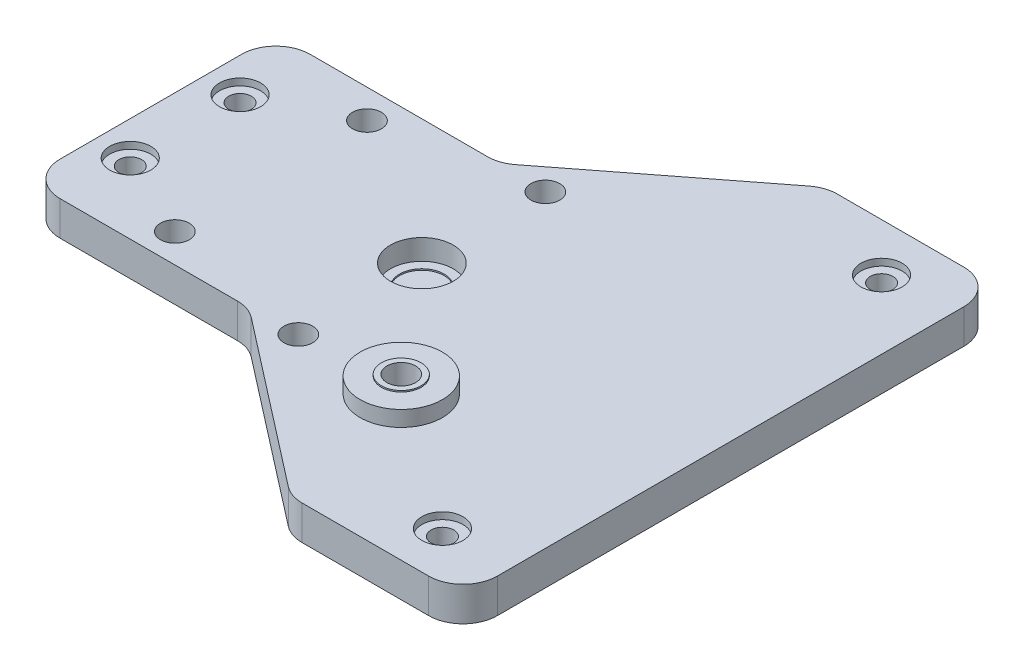
ISO-10303-21;
HEADER;
FILE_DESCRIPTION(('STEP AP214'),'2;1');
FILE_NAME('part.step','',(''),(''),'','','');
FILE_SCHEMA(('AUTOMOTIVE_DESIGN { 1 0 10303 214 1 1 1 1 }'));
ENDSEC;
DATA;
#1=APPLICATION_CONTEXT('core data for automotive mechanical design processes');
#2=APPLICATION_PROTOCOL_DEFINITION('international standard','automotive_design',2000,#1);
#3=PRODUCT_CONTEXT('',#1,'mechanical');
#4=PRODUCT('Part','Part','',(#3));
#5=PRODUCT_RELATED_PRODUCT_CATEGORY('part','',(#4));
#6=PRODUCT_DEFINITION_FORMATION('','',#4);
#7=PRODUCT_DEFINITION_CONTEXT('part definition',#1,'design');
#8=PRODUCT_DEFINITION('design','',#6,#7);
#9=PRODUCT_DEFINITION_SHAPE('','',#8);
#10=(LENGTH_UNIT() NAMED_UNIT(*) SI_UNIT(.MILLI.,.METRE.));
#11=(NAMED_UNIT(*) PLANE_ANGLE_UNIT() SI_UNIT($,.RADIAN.));
#12=(NAMED_UNIT(*) SI_UNIT($,.STERADIAN.) SOLID_ANGLE_UNIT());
#13=UNCERTAINTY_MEASURE_WITH_UNIT(LENGTH_MEASURE(1.E-05),#10,'distance_accuracy_value','');
#14=(GEOMETRIC_REPRESENTATION_CONTEXT(3) GLOBAL_UNCERTAINTY_ASSIGNED_CONTEXT((#13)) GLOBAL_UNIT_ASSIGNED_CONTEXT((#10,
#11,#12)) REPRESENTATION_CONTEXT('',''));
#15=CARTESIAN_POINT('',(0.,0.,0.));
#16=DIRECTION('',(0.,0.,1.));
#17=DIRECTION('',(1.,0.,0.));
#18=AXIS2_PLACEMENT_3D('',#15,#16,#17);
#19=CARTESIAN_POINT('',(-34.5,0.,-8.));
#20=DIRECTION('',(0.,1.,0.));
#21=DIRECTION('',(0.,0.,1.));
#22=AXIS2_PLACEMENT_3D('',#19,#20,#21);
#23=CYLINDRICAL_SURFACE('',#22,1.65);
#24=CARTESIAN_POINT('',(-34.5,0.,-8.));
#25=DIRECTION('',(0.,1.,0.));
#26=DIRECTION('',(0.,0.,1.));
#27=AXIS2_PLACEMENT_3D('',#24,#25,#26);
#28=CIRCLE('',#27,1.65);
#29=CARTESIAN_POINT('',(-34.5,0.,-6.35));
#30=VERTEX_POINT('',#29);
#31=EDGE_CURVE('E214',#30,#30,#28,.T.);
#32=ORIENTED_EDGE('',*,*,#31,.F.);
#33=EDGE_LOOP('',(#32));
#34=FACE_BOUND('',#33,.T.);
#35=CARTESIAN_POINT('',(-34.5,4.,-8.));
#36=DIRECTION('',(0.,1.,0.));
#37=DIRECTION('',(0.,0.,1.));
#38=AXIS2_PLACEMENT_3D('',#35,#36,#37);
#39=CIRCLE('',#38,1.65);
#40=CARTESIAN_POINT('',(-34.5,4.,-6.35));
#41=VERTEX_POINT('',#40);
#42=EDGE_CURVE('E44',#41,#41,#39,.F.);
#43=ORIENTED_EDGE('',*,*,#42,.F.);
#44=EDGE_LOOP('',(#43));
#45=FACE_BOUND('',#44,.T.);
#46=ADVANCED_FACE('F40',(#34,#45),#23,.F.);
#47=CARTESIAN_POINT('',(-34.5,0.,8.));
#48=DIRECTION('',(0.,1.,0.));
#49=DIRECTION('',(0.,0.,1.));
#50=AXIS2_PLACEMENT_3D('',#47,#48,#49);
#51=CYLINDRICAL_SURFACE('',#50,1.65);
#52=CARTESIAN_POINT('',(-34.5,0.,8.));
#53=DIRECTION('',(0.,1.,0.));
#54=DIRECTION('',(0.,0.,1.));
#55=AXIS2_PLACEMENT_3D('',#52,#53,#54);
#56=CIRCLE('',#55,1.65);
#57=CARTESIAN_POINT('',(-34.5,0.,9.65));
#58=VERTEX_POINT('',#57);
#59=EDGE_CURVE('E218',#58,#58,#56,.T.);
#60=ORIENTED_EDGE('',*,*,#59,.F.);
#61=EDGE_LOOP('',(#60));
#62=FACE_BOUND('',#61,.T.);
#63=CARTESIAN_POINT('',(-34.5,4.,8.));
#64=DIRECTION('',(0.,1.,0.));
#65=DIRECTION('',(0.,0.,1.));
#66=AXIS2_PLACEMENT_3D('',#63,#64,#65);
#67=CIRCLE('',#66,1.65);
#68=CARTESIAN_POINT('',(-34.5,4.,9.65));
#69=VERTEX_POINT('',#68);
#70=EDGE_CURVE('E323',#69,#69,#67,.F.);
#71=ORIENTED_EDGE('',*,*,#70,.F.);
#72=EDGE_LOOP('',(#71));
#73=FACE_BOUND('',#72,.T.);
#74=ADVANCED_FACE('F433',(#62,#73),#51,.F.);
#75=CARTESIAN_POINT('',(35.,0.,32.));
#76=DIRECTION('',(0.,1.,0.));
#77=DIRECTION('',(0.,0.,1.));
#78=AXIS2_PLACEMENT_3D('',#75,#76,#77);
#79=CYLINDRICAL_SURFACE('',#78,1.65);
#80=CARTESIAN_POINT('',(35.,0.,32.));
#81=DIRECTION('',(0.,1.,0.));
#82=DIRECTION('',(0.,0.,1.));
#83=AXIS2_PLACEMENT_3D('',#80,#81,#82);
#84=CIRCLE('',#83,1.65);
#85=CARTESIAN_POINT('',(35.,0.,33.65));
#86=VERTEX_POINT('',#85);
#87=EDGE_CURVE('E348',#86,#86,#84,.T.);
#88=ORIENTED_EDGE('',*,*,#87,.F.);
#89=EDGE_LOOP('',(#88));
#90=FACE_BOUND('',#89,.T.);
#91=CARTESIAN_POINT('',(35.,4.,32.));
#92=DIRECTION('',(0.,1.,0.));
#93=DIRECTION('',(0.,0.,1.));
#94=AXIS2_PLACEMENT_3D('',#91,#92,#93);
#95=CIRCLE('',#94,1.65);
#96=CARTESIAN_POINT('',(35.,4.,33.65));
#97=VERTEX_POINT('',#96);
#98=EDGE_CURVE('E320',#97,#97,#95,.F.);
#99=ORIENTED_EDGE('',*,*,#98,.F.);
#100=EDGE_LOOP('',(#99));
#101=FACE_BOUND('',#100,.T.);
#102=ADVANCED_FACE('F439',(#90,#101),#79,.F.);
#103=CARTESIAN_POINT('',(35.,0.,-32.));
#104=DIRECTION('',(0.,1.,0.));
#105=DIRECTION('',(0.,0.,1.));
#106=AXIS2_PLACEMENT_3D('',#103,#104,#105);
#107=CYLINDRICAL_SURFACE('',#106,1.65);
#108=CARTESIAN_POINT('',(35.,0.,-32.));
#109=DIRECTION('',(0.,1.,0.));
#110=DIRECTION('',(0.,0.,1.));
#111=AXIS2_PLACEMENT_3D('',#108,#109,#110);
#112=CIRCLE('',#111,1.65);
#113=CARTESIAN_POINT('',(35.,0.,-30.35));
#114=VERTEX_POINT('',#113);
#115=EDGE_CURVE('E349',#114,#114,#112,.T.);
#116=ORIENTED_EDGE('',*,*,#115,.F.);
#117=EDGE_LOOP('',(#116));
#118=FACE_BOUND('',#117,.T.);
#119=CARTESIAN_POINT('',(35.,4.,-32.));
#120=DIRECTION('',(0.,1.,0.));
#121=DIRECTION('',(0.,0.,1.));
#122=AXIS2_PLACEMENT_3D('',#119,#120,#121);
#123=CIRCLE('',#122,1.65);
#124=CARTESIAN_POINT('',(35.,4.,-30.35));
#125=VERTEX_POINT('',#124);
#126=EDGE_CURVE('E317',#125,#125,#123,.F.);
#127=ORIENTED_EDGE('',*,*,#126,.F.);
#128=EDGE_LOOP('',(#127));
#129=FACE_BOUND('',#128,.T.);
#130=ADVANCED_FACE('F518',(#118,#129),#107,.F.);
#131=CARTESIAN_POINT('',(15.,7.275,18.));
#132=DIRECTION('',(0.,1.,0.));
#133=DIRECTION('',(0.,0.,1.));
#134=AXIS2_PLACEMENT_3D('',#131,#132,#133);
#135=PLANE('',#134);
#136=CARTESIAN_POINT('',(15.,7.275,18.));
#137=DIRECTION('',(0.,1.,0.));
#138=DIRECTION('',(0.,0.,1.));
#139=AXIS2_PLACEMENT_3D('',#136,#137,#138);
#140=CIRCLE('',#139,6.);
#141=CARTESIAN_POINT('',(15.,7.275,24.));
#142=VERTEX_POINT('',#141);
#143=EDGE_CURVE('E344',#142,#142,#140,.T.);
#144=ORIENTED_EDGE('',*,*,#143,.T.);
#145=EDGE_LOOP('',(#144));
#146=FACE_BOUND('',#145,.T.);
#147=CARTESIAN_POINT('',(15.,7.275,18.));
#148=DIRECTION('',(0.,1.,0.));
#149=DIRECTION('',(0.,0.,1.));
#150=AXIS2_PLACEMENT_3D('',#147,#148,#149);
#151=CIRCLE('',#150,2.9);
#152=CARTESIAN_POINT('',(15.,7.275,20.9));
#153=VERTEX_POINT('',#152);
#154=EDGE_CURVE('E332',#153,#153,#151,.T.);
#155=ORIENTED_EDGE('',*,*,#154,.F.);
#156=EDGE_LOOP('',(#155));
#157=FACE_BOUND('',#156,.T.);
#158=ADVANCED_FACE('F482',(#146,#157),#135,.T.);
#159=CARTESIAN_POINT('',(0.,5.,0.));
#160=DIRECTION('',(0.,-1.,0.));
#161=DIRECTION('',(0.,0.,-1.));
#162=AXIS2_PLACEMENT_3D('',#159,#160,#161);
#163=PLANE('',#162);
#164=CARTESIAN_POINT('',(35.,5.,-32.));
#165=DIRECTION('',(0.,1.,0.));
#166=DIRECTION('',(0.,0.,1.));
#167=AXIS2_PLACEMENT_3D('',#164,#165,#166);
#168=CIRCLE('',#167,3.);
#169=CARTESIAN_POINT('',(35.,5.,-29.));
#170=VERTEX_POINT('',#169);
#171=EDGE_CURVE('E761',#170,#170,#168,.T.);
#172=ORIENTED_EDGE('',*,*,#171,.F.);
#173=EDGE_LOOP('',(#172));
#174=FACE_BOUND('',#173,.T.);
#175=CARTESIAN_POINT('',(35.,5.,32.));
#176=DIRECTION('',(0.,1.,0.));
#177=DIRECTION('',(0.,0.,1.));
#178=AXIS2_PLACEMENT_3D('',#175,#176,#177);
#179=CIRCLE('',#178,3.);
#180=CARTESIAN_POINT('',(35.,5.,35.));
#181=VERTEX_POINT('',#180);
#182=EDGE_CURVE('E753',#181,#181,#179,.T.);
#183=ORIENTED_EDGE('',*,*,#182,.F.);
#184=EDGE_LOOP('',(#183));
#185=FACE_BOUND('',#184,.T.);
#186=CARTESIAN_POINT('',(-34.5,5.,8.));
#187=DIRECTION('',(0.,1.,0.));
#188=DIRECTION('',(0.,0.,1.));
#189=AXIS2_PLACEMENT_3D('',#186,#187,#188);
#190=CIRCLE('',#189,3.);
#191=CARTESIAN_POINT('',(-34.5,5.,11.));
#192=VERTEX_POINT('',#191);
#193=EDGE_CURVE('E746',#192,#192,#190,.T.);
#194=ORIENTED_EDGE('',*,*,#193,.F.);
#195=EDGE_LOOP('',(#194));
#196=FACE_BOUND('',#195,.T.);
#197=CARTESIAN_POINT('',(-34.5,5.,-8.));
#198=DIRECTION('',(0.,1.,0.));
#199=DIRECTION('',(0.,0.,1.));
#200=AXIS2_PLACEMENT_3D('',#197,#198,#199);
#201=CIRCLE('',#200,3.);
#202=CARTESIAN_POINT('',(-34.5,5.,-5.));
#203=VERTEX_POINT('',#202);
#204=EDGE_CURVE('E341',#203,#203,#201,.T.);
#205=ORIENTED_EDGE('',*,*,#204,.F.);
#206=EDGE_LOOP('',(#205));
#207=FACE_BOUND('',#206,.T.);
#208=CARTESIAN_POINT('',(-22.,5.,14.));
#209=DIRECTION('',(0.,1.,0.));
#210=DIRECTION('',(0.,0.,1.));
#211=AXIS2_PLACEMENT_3D('',#208,#209,#210);
#212=CIRCLE('',#211,2.1);
#213=CARTESIAN_POINT('',(-22.,5.,16.1));
#214=VERTEX_POINT('',#213);
#215=EDGE_CURVE('E239',#214,#214,#212,.T.);
#216=ORIENTED_EDGE('',*,*,#215,.F.);
#217=EDGE_LOOP('',(#216));
#218=FACE_BOUND('',#217,.T.);
#219=CARTESIAN_POINT('',(0.,5.,18.));
#220=DIRECTION('',(0.,1.,0.));
#221=DIRECTION('',(0.,0.,1.));
#222=AXIS2_PLACEMENT_3D('',#219,#220,#221);
#223=CIRCLE('',#222,2.1);
#224=CARTESIAN_POINT('',(0.,5.,20.1));
#225=VERTEX_POINT('',#224);
#226=EDGE_CURVE('E245',#225,#225,#223,.T.);
#227=ORIENTED_EDGE('',*,*,#226,.F.);
#228=EDGE_LOOP('',(#227));
#229=FACE_BOUND('',#228,.T.);
#230=CARTESIAN_POINT('',(0.,5.,-18.));
#231=DIRECTION('',(0.,1.,0.));
#232=DIRECTION('',(0.,0.,1.));
#233=AXIS2_PLACEMENT_3D('',#230,#231,#232);
#234=CIRCLE('',#233,2.1);
#235=CARTESIAN_POINT('',(0.,5.,-15.9));
#236=VERTEX_POINT('',#235);
#237=EDGE_CURVE('E251',#236,#236,#234,.T.);
#238=ORIENTED_EDGE('',*,*,#237,.F.);
#239=EDGE_LOOP('',(#238));
#240=FACE_BOUND('',#239,.T.);
#241=CARTESIAN_POINT('',(-22.,5.,-14.));
#242=DIRECTION('',(0.,1.,0.));
#243=DIRECTION('',(0.,0.,1.));
#244=AXIS2_PLACEMENT_3D('',#241,#242,#243);
#245=CIRCLE('',#244,2.1);
#246=CARTESIAN_POINT('',(-22.,5.,-11.9));
#247=VERTEX_POINT('',#246);
#248=EDGE_CURVE('E257',#247,#247,#245,.T.);
#249=ORIENTED_EDGE('',*,*,#248,.F.);
#250=EDGE_LOOP('',(#249));
#251=FACE_BOUND('',#250,.T.);
#252=DIRECTION('',(1.,0.,0.));
#253=VECTOR('',#252,1.);
#254=CARTESIAN_POINT('',(19.8422113683114,5.,39.));
#255=LINE('',#254,#253);
#256=CARTESIAN_POINT('',(21.5537987356417,5.,39.));
#257=VERTEX_POINT('',#256);
#258=CARTESIAN_POINT('',(40.,5.,38.9999999999999));
#259=VERTEX_POINT('',#258);
#260=EDGE_CURVE('E357',#257,#259,#255,.T.);
#261=ORIENTED_EDGE('',*,*,#260,.T.);
#262=CARTESIAN_POINT('',(40.,5.,33.9999999999999));
#263=DIRECTION('',(0.,-1.,0.));
#264=DIRECTION('',(0.,0.,-1.));
#265=AXIS2_PLACEMENT_3D('',#262,#263,#264);
#266=CIRCLE('',#265,5.);
#267=CARTESIAN_POINT('',(45.,5.,34.));
#268=VERTEX_POINT('',#267);
#269=EDGE_CURVE('E279',#259,#268,#266,.F.);
#270=ORIENTED_EDGE('',*,*,#269,.T.);
#271=DIRECTION('',(0.,0.,-1.));
#272=VECTOR('',#271,1.);
#273=CARTESIAN_POINT('',(45.,5.,-30.));
#274=LINE('',#273,#272);
#275=CARTESIAN_POINT('',(45.,5.,-34.0000000000001));
#276=VERTEX_POINT('',#275);
#277=EDGE_CURVE('E263',#268,#276,#274,.T.);
#278=ORIENTED_EDGE('',*,*,#277,.T.);
#279=CARTESIAN_POINT('',(40.,5.,-34.0000000000001));
#280=DIRECTION('',(0.,-1.,0.));
#281=DIRECTION('',(0.,0.,-1.));
#282=AXIS2_PLACEMENT_3D('',#279,#280,#281);
#283=CIRCLE('',#282,5.);
#284=CARTESIAN_POINT('',(40.,5.,-39.0000000000001));
#285=VERTEX_POINT('',#284);
#286=EDGE_CURVE('E273',#276,#285,#283,.F.);
#287=ORIENTED_EDGE('',*,*,#286,.T.);
#288=DIRECTION('',(-1.,0.,0.));
#289=VECTOR('',#288,1.);
#290=CARTESIAN_POINT('',(45.,5.,-39.0000000000001));
#291=LINE('',#290,#289);
#292=CARTESIAN_POINT('',(21.5537987356417,5.,-39.0000000000001));
#293=VERTEX_POINT('',#292);
#294=EDGE_CURVE('E360',#285,#293,#291,.T.);
#295=ORIENTED_EDGE('',*,*,#294,.T.);
#296=CARTESIAN_POINT('',(21.5537987356417,5.,-34.0000000000001));
#297=DIRECTION('',(0.,-1.,0.));
#298=DIRECTION('',(0.,0.,-1.));
#299=AXIS2_PLACEMENT_3D('',#296,#297,#298);
#300=CIRCLE('',#299,5.);
#301=CARTESIAN_POINT('',(18.4896811391723,5.,-37.9510990059738));
#302=VERTEX_POINT('',#301);
#303=EDGE_CURVE('E275',#293,#302,#300,.F.);
#304=ORIENTED_EDGE('',*,*,#303,.T.);
#305=DIRECTION('',(0.790219801194743,0.,-0.612823519293884));
#306=VECTOR('',#305,1.);
#307=CARTESIAN_POINT('',(-6.95101931897184,5.,-18.2215762016987));
#308=LINE('',#307,#306);
#309=CARTESIAN_POINT('',(-5.59848908983268,5.,-19.270477195725));
#310=VERTEX_POINT('',#309);
#311=EDGE_CURVE('E192',#310,#302,#308,.T.);
#312=ORIENTED_EDGE('',*,*,#311,.F.);
#313=CARTESIAN_POINT('',(-8.6626066863021,5.,-23.2215762016987));
#314=DIRECTION('',(0.,-1.,0.));
#315=DIRECTION('',(0.,0.,-1.));
#316=AXIS2_PLACEMENT_3D('',#313,#314,#315);
#317=CIRCLE('',#316,5.);
#318=CARTESIAN_POINT('',(-8.6626066863021,5.,-18.2215762016987));
#319=VERTEX_POINT('',#318);
#320=EDGE_CURVE('E314',#310,#319,#317,.T.);
#321=ORIENTED_EDGE('',*,*,#320,.T.);
#322=DIRECTION('',(1.,0.,0.));
#323=VECTOR('',#322,1.);
#324=CARTESIAN_POINT('',(-22.,5.,-18.2215762016987));
#325=LINE('',#324,#323);
#326=CARTESIAN_POINT('',(-34.5,5.,-18.2215762016987));
#327=VERTEX_POINT('',#326);
#328=EDGE_CURVE('E208',#327,#319,#325,.T.);
#329=ORIENTED_EDGE('',*,*,#328,.F.);
#330=CARTESIAN_POINT('',(-34.5,5.,-13.2215762016987));
#331=DIRECTION('',(0.,-1.,0.));
#332=DIRECTION('',(0.,0.,1.));
#333=AXIS2_PLACEMENT_3D('',#330,#331,#332);
#334=CIRCLE('',#333,5.);
#335=CARTESIAN_POINT('',(-39.5,5.,-13.2215762016987));
#336=VERTEX_POINT('',#335);
#337=EDGE_CURVE('E205',#336,#327,#334,.T.);
#338=ORIENTED_EDGE('',*,*,#337,.F.);
#339=DIRECTION('',(0.,0.,-1.));
#340=VECTOR('',#339,1.);
#341=CARTESIAN_POINT('',(-39.5,5.,-13.2215762016987));
#342=LINE('',#341,#340);
#343=CARTESIAN_POINT('',(-39.5,5.,13.2215762016987));
#344=VERTEX_POINT('',#343);
#345=EDGE_CURVE('E202',#344,#336,#342,.T.);
#346=ORIENTED_EDGE('',*,*,#345,.F.);
#347=CARTESIAN_POINT('',(-34.5,5.,13.2215762016987));
#348=DIRECTION('',(0.,-1.,0.));
#349=DIRECTION('',(0.,0.,1.));
#350=AXIS2_PLACEMENT_3D('',#347,#348,#349);
#351=CIRCLE('',#350,5.);
#352=CARTESIAN_POINT('',(-34.5,5.,18.2215762016987));
#353=VERTEX_POINT('',#352);
#354=EDGE_CURVE('E200',#353,#344,#351,.T.);
#355=ORIENTED_EDGE('',*,*,#354,.F.);
#356=DIRECTION('',(-1.,0.,0.));
#357=VECTOR('',#356,1.);
#358=CARTESIAN_POINT('',(-34.5,5.,18.2215762016987));
#359=LINE('',#358,#357);
#360=CARTESIAN_POINT('',(-8.66260668630204,5.,18.2215762016987));
#361=VERTEX_POINT('',#360);
#362=EDGE_CURVE('E176',#361,#353,#359,.T.);
#363=ORIENTED_EDGE('',*,*,#362,.F.);
#364=CARTESIAN_POINT('',(-8.66260668630204,5.,23.2215762016987));
#365=DIRECTION('',(0.,-1.,0.));
#366=DIRECTION('',(0.,0.,-1.));
#367=AXIS2_PLACEMENT_3D('',#364,#365,#366);
#368=CIRCLE('',#367,5.);
#369=CARTESIAN_POINT('',(-5.59848908983262,5.,19.270477195725));
#370=VERTEX_POINT('',#369);
#371=EDGE_CURVE('E311',#361,#370,#368,.T.);
#372=ORIENTED_EDGE('',*,*,#371,.T.);
#373=DIRECTION('',(-0.790219801194744,0.,-0.612823519293882));
#374=VECTOR('',#373,1.);
#375=CARTESIAN_POINT('',(-6.95101931897178,5.,18.2215762016987));
#376=LINE('',#375,#374);
#377=CARTESIAN_POINT('',(18.4896811391723,5.,37.9510990059737));
#378=VERTEX_POINT('',#377);
#379=EDGE_CURVE('E195',#378,#370,#376,.T.);
#380=ORIENTED_EDGE('',*,*,#379,.F.);
#381=CARTESIAN_POINT('',(21.5537987356417,5.,34.));
#382=DIRECTION('',(0.,-1.,0.));
#383=DIRECTION('',(0.,0.,-1.));
#384=AXIS2_PLACEMENT_3D('',#381,#382,#383);
#385=CIRCLE('',#384,5.);
#386=EDGE_CURVE('E277',#378,#257,#385,.F.);
#387=ORIENTED_EDGE('',*,*,#386,.T.);
#388=EDGE_LOOP('',(#261,#270,#278,#287,#295,#304,#312,#321,#329,#338,#346,#355,#363,#372,#380,#387));
#389=FACE_BOUND('',#388,.T.);
#390=CARTESIAN_POINT('',(0.,5.,0.));
#391=DIRECTION('',(0.,1.,0.));
#392=DIRECTION('',(0.,0.,1.));
#393=AXIS2_PLACEMENT_3D('',#390,#391,#392);
#394=CIRCLE('',#393,4.575);
#395=CARTESIAN_POINT('',(0.,5.,4.575));
#396=VERTEX_POINT('',#395);
#397=EDGE_CURVE('E227',#396,#396,#394,.T.);
#398=ORIENTED_EDGE('',*,*,#397,.F.);
#399=EDGE_LOOP('',(#398));
#400=FACE_BOUND('',#399,.T.);
#401=CARTESIAN_POINT('',(15.,5.,18.));
#402=DIRECTION('',(0.,-1.,0.));
#403=DIRECTION('',(0.,0.,-1.));
#404=AXIS2_PLACEMENT_3D('',#401,#402,#403);
#405=CIRCLE('',#404,6.);
#406=CARTESIAN_POINT('',(15.,5.,12.));
#407=VERTEX_POINT('',#406);
#408=EDGE_CURVE('E11',#407,#407,#405,.F.);
#409=ORIENTED_EDGE('',*,*,#408,.F.);
#410=EDGE_LOOP('',(#409));
#411=FACE_BOUND('',#410,.T.);
#412=ADVANCED_FACE('F376',(#174,#185,#196,#207,#218,#229,#240,#251,#389,#400,#411),#163,.F.);
#413=CARTESIAN_POINT('',(0.,0.,0.));
#414=DIRECTION('',(0.,-1.,0.));
#415=DIRECTION('',(0.,0.,-1.));
#416=AXIS2_PLACEMENT_3D('',#413,#414,#415);
#417=PLANE('',#416);
#418=ORIENTED_EDGE('',*,*,#115,.T.);
#419=EDGE_LOOP('',(#418));
#420=FACE_BOUND('',#419,.T.);
#421=ORIENTED_EDGE('',*,*,#87,.T.);
#422=EDGE_LOOP('',(#421));
#423=FACE_BOUND('',#422,.T.);
#424=DIRECTION('',(0.,0.,-1.));
#425=VECTOR('',#424,1.);
#426=CARTESIAN_POINT('',(45.,0.,-30.));
#427=LINE('',#426,#425);
#428=CARTESIAN_POINT('',(45.,0.,34.));
#429=VERTEX_POINT('',#428);
#430=CARTESIAN_POINT('',(45.,0.,-34.0000000000001));
#431=VERTEX_POINT('',#430);
#432=EDGE_CURVE('E260',#429,#431,#427,.T.);
#433=ORIENTED_EDGE('',*,*,#432,.F.);
#434=CARTESIAN_POINT('',(40.,0.,33.9999999999999));
#435=DIRECTION('',(0.,-1.,0.));
#436=DIRECTION('',(0.,0.,-1.));
#437=AXIS2_PLACEMENT_3D('',#434,#435,#436);
#438=CIRCLE('',#437,5.);
#439=CARTESIAN_POINT('',(40.,0.,38.9999999999999));
#440=VERTEX_POINT('',#439);
#441=EDGE_CURVE('E291',#429,#440,#438,.T.);
#442=ORIENTED_EDGE('',*,*,#441,.T.);
#443=DIRECTION('',(1.,0.,0.));
#444=VECTOR('',#443,1.);
#445=CARTESIAN_POINT('',(19.8422113683114,0.,39.));
#446=LINE('',#445,#444);
#447=CARTESIAN_POINT('',(21.5537987356417,0.,39.));
#448=VERTEX_POINT('',#447);
#449=EDGE_CURVE('E352',#448,#440,#446,.T.);
#450=ORIENTED_EDGE('',*,*,#449,.F.);
#451=CARTESIAN_POINT('',(21.5537987356417,0.,34.));
#452=DIRECTION('',(0.,-1.,0.));
#453=DIRECTION('',(0.,0.,-1.));
#454=AXIS2_PLACEMENT_3D('',#451,#452,#453);
#455=CIRCLE('',#454,5.);
#456=CARTESIAN_POINT('',(18.4896811391723,0.,37.9510990059737));
#457=VERTEX_POINT('',#456);
#458=EDGE_CURVE('E289',#448,#457,#455,.T.);
#459=ORIENTED_EDGE('',*,*,#458,.T.);
#460=DIRECTION('',(-0.790219801194744,0.,-0.612823519293882));
#461=VECTOR('',#460,1.);
#462=CARTESIAN_POINT('',(-6.95101931897178,0.,18.2215762016987));
#463=LINE('',#462,#461);
#464=CARTESIAN_POINT('',(-5.59848908983262,0.,19.270477195725));
#465=VERTEX_POINT('',#464);
#466=EDGE_CURVE('E170',#457,#465,#463,.T.);
#467=ORIENTED_EDGE('',*,*,#466,.T.);
#468=CARTESIAN_POINT('',(-8.66260668630204,0.,23.2215762016987));
#469=DIRECTION('',(0.,-1.,0.));
#470=DIRECTION('',(0.,0.,-1.));
#471=AXIS2_PLACEMENT_3D('',#468,#469,#470);
#472=CIRCLE('',#471,5.);
#473=CARTESIAN_POINT('',(-8.66260668630204,0.,18.2215762016987));
#474=VERTEX_POINT('',#473);
#475=EDGE_CURVE('E166',#465,#474,#472,.F.);
#476=ORIENTED_EDGE('',*,*,#475,.T.);
#477=DIRECTION('',(-1.,0.,0.));
#478=VECTOR('',#477,1.);
#479=CARTESIAN_POINT('',(-8.29751994050381,0.,18.2215762016987));
#480=LINE('',#479,#478);
#481=CARTESIAN_POINT('',(-34.5,0.,18.2215762016987));
#482=VERTEX_POINT('',#481);
#483=EDGE_CURVE('E156',#474,#482,#480,.T.);
#484=ORIENTED_EDGE('',*,*,#483,.T.);
#485=CARTESIAN_POINT('',(-34.5,0.,13.2215762016987));
#486=DIRECTION('',(0.,-1.,0.));
#487=DIRECTION('',(0.,0.,1.));
#488=AXIS2_PLACEMENT_3D('',#485,#486,#487);
#489=CIRCLE('',#488,5.);
#490=CARTESIAN_POINT('',(-39.5,0.,13.2215762016987));
#491=VERTEX_POINT('',#490);
#492=EDGE_CURVE('E163',#482,#491,#489,.T.);
#493=ORIENTED_EDGE('',*,*,#492,.T.);
#494=DIRECTION('',(0.,0.,-1.));
#495=VECTOR('',#494,1.);
#496=CARTESIAN_POINT('',(-39.5,0.,-13.2215762016987));
#497=LINE('',#496,#495);
#498=CARTESIAN_POINT('',(-39.5,0.,-13.2215762016987));
#499=VERTEX_POINT('',#498);
#500=EDGE_CURVE('E185',#491,#499,#497,.T.);
#501=ORIENTED_EDGE('',*,*,#500,.T.);
#502=CARTESIAN_POINT('',(-34.5,0.,-13.2215762016987));
#503=DIRECTION('',(0.,-1.,0.));
#504=DIRECTION('',(0.,0.,1.));
#505=AXIS2_PLACEMENT_3D('',#502,#503,#504);
#506=CIRCLE('',#505,5.);
#507=CARTESIAN_POINT('',(-34.5,0.,-18.2215762016987));
#508=VERTEX_POINT('',#507);
#509=EDGE_CURVE('E181',#499,#508,#506,.T.);
#510=ORIENTED_EDGE('',*,*,#509,.T.);
#511=DIRECTION('',(1.,0.,0.));
#512=VECTOR('',#511,1.);
#513=CARTESIAN_POINT('',(-22.,0.,-18.2215762016987));
#514=LINE('',#513,#512);
#515=CARTESIAN_POINT('',(-8.6626066863021,0.,-18.2215762016987));
#516=VERTEX_POINT('',#515);
#517=EDGE_CURVE('E211',#508,#516,#514,.T.);
#518=ORIENTED_EDGE('',*,*,#517,.T.);
#519=CARTESIAN_POINT('',(-8.6626066863021,0.,-23.2215762016987));
#520=DIRECTION('',(0.,-1.,0.));
#521=DIRECTION('',(0.,0.,-1.));
#522=AXIS2_PLACEMENT_3D('',#519,#520,#521);
#523=CIRCLE('',#522,5.);
#524=CARTESIAN_POINT('',(-5.59848908983268,0.,-19.270477195725));
#525=VERTEX_POINT('',#524);
#526=EDGE_CURVE('E49',#516,#525,#523,.F.);
#527=ORIENTED_EDGE('',*,*,#526,.T.);
#528=DIRECTION('',(0.790219801194743,0.,-0.612823519293884));
#529=VECTOR('',#528,1.);
#530=CARTESIAN_POINT('',(-6.95101931897184,0.,-18.2215762016987));
#531=LINE('',#530,#529);
#532=CARTESIAN_POINT('',(18.4896811391723,0.,-37.9510990059738));
#533=VERTEX_POINT('',#532);
#534=EDGE_CURVE('E366',#525,#533,#531,.T.);
#535=ORIENTED_EDGE('',*,*,#534,.T.);
#536=CARTESIAN_POINT('',(21.5537987356417,0.,-34.0000000000001));
#537=DIRECTION('',(0.,-1.,0.));
#538=DIRECTION('',(0.,0.,-1.));
#539=AXIS2_PLACEMENT_3D('',#536,#537,#538);
#540=CIRCLE('',#539,5.);
#541=CARTESIAN_POINT('',(21.5537987356417,0.,-39.0000000000001));
#542=VERTEX_POINT('',#541);
#543=EDGE_CURVE('E57',#533,#542,#540,.T.);
#544=ORIENTED_EDGE('',*,*,#543,.T.);
#545=DIRECTION('',(-1.,0.,0.));
#546=VECTOR('',#545,1.);
#547=CARTESIAN_POINT('',(45.,0.,-39.0000000000001));
#548=LINE('',#547,#546);
#549=CARTESIAN_POINT('',(40.,0.,-39.0000000000001));
#550=VERTEX_POINT('',#549);
#551=EDGE_CURVE('E196',#550,#542,#548,.T.);
#552=ORIENTED_EDGE('',*,*,#551,.F.);
#553=CARTESIAN_POINT('',(40.,0.,-34.0000000000001));
#554=DIRECTION('',(0.,-1.,0.));
#555=DIRECTION('',(0.,0.,-1.));
#556=AXIS2_PLACEMENT_3D('',#553,#554,#555);
#557=CIRCLE('',#556,5.);
#558=EDGE_CURVE('E286',#550,#431,#557,.T.);
#559=ORIENTED_EDGE('',*,*,#558,.T.);
#560=EDGE_LOOP('',(#433,#442,#450,#459,#467,#476,#484,#493,#501,#510,#518,#527,#535,#544,#552,#559));
#561=FACE_BOUND('',#560,.T.);
#562=ORIENTED_EDGE('',*,*,#59,.T.);
#563=EDGE_LOOP('',(#562));
#564=FACE_BOUND('',#563,.T.);
#565=ORIENTED_EDGE('',*,*,#31,.T.);
#566=EDGE_LOOP('',(#565));
#567=FACE_BOUND('',#566,.T.);
#568=CARTESIAN_POINT('',(-22.,0.,14.));
#569=DIRECTION('',(0.,1.,0.));
#570=DIRECTION('',(0.,0.,1.));
#571=AXIS2_PLACEMENT_3D('',#568,#569,#570);
#572=CIRCLE('',#571,2.1);
#573=CARTESIAN_POINT('',(-22.,0.,16.1));
#574=VERTEX_POINT('',#573);
#575=EDGE_CURVE('E238',#574,#574,#572,.T.);
#576=ORIENTED_EDGE('',*,*,#575,.T.);
#577=EDGE_LOOP('',(#576));
#578=FACE_BOUND('',#577,.T.);
#579=CARTESIAN_POINT('',(0.,0.,-18.));
#580=DIRECTION('',(0.,1.,0.));
#581=DIRECTION('',(0.,0.,1.));
#582=AXIS2_PLACEMENT_3D('',#579,#580,#581);
#583=CIRCLE('',#582,2.1);
#584=CARTESIAN_POINT('',(0.,0.,-15.9));
#585=VERTEX_POINT('',#584);
#586=EDGE_CURVE('E248',#585,#585,#583,.T.);
#587=ORIENTED_EDGE('',*,*,#586,.T.);
#588=EDGE_LOOP('',(#587));
#589=FACE_BOUND('',#588,.T.);
#590=CARTESIAN_POINT('',(-22.,0.,-14.));
#591=DIRECTION('',(0.,1.,0.));
#592=DIRECTION('',(0.,0.,1.));
#593=AXIS2_PLACEMENT_3D('',#590,#591,#592);
#594=CIRCLE('',#593,2.1);
#595=CARTESIAN_POINT('',(-22.,0.,-11.9));
#596=VERTEX_POINT('',#595);
#597=EDGE_CURVE('E254',#596,#596,#594,.T.);
#598=ORIENTED_EDGE('',*,*,#597,.T.);
#599=EDGE_LOOP('',(#598));
#600=FACE_BOUND('',#599,.T.);
#601=CARTESIAN_POINT('',(0.,0.,18.));
#602=DIRECTION('',(0.,1.,0.));
#603=DIRECTION('',(0.,0.,1.));
#604=AXIS2_PLACEMENT_3D('',#601,#602,#603);
#605=CIRCLE('',#604,2.1);
#606=CARTESIAN_POINT('',(0.,0.,20.1));
#607=VERTEX_POINT('',#606);
#608=EDGE_CURVE('E242',#607,#607,#605,.T.);
#609=ORIENTED_EDGE('',*,*,#608,.T.);
#610=EDGE_LOOP('',(#609));
#611=FACE_BOUND('',#610,.T.);
#612=CARTESIAN_POINT('',(15.,0.,18.));
#613=DIRECTION('',(0.,1.,0.));
#614=DIRECTION('',(0.,0.,1.));
#615=AXIS2_PLACEMENT_3D('',#612,#613,#614);
#616=CIRCLE('',#615,2.1);
#617=CARTESIAN_POINT('',(15.,0.,20.1));
#618=VERTEX_POINT('',#617);
#619=EDGE_CURVE('E233',#618,#618,#616,.T.);
#620=ORIENTED_EDGE('',*,*,#619,.T.);
#621=EDGE_LOOP('',(#620));
#622=FACE_BOUND('',#621,.T.);
#623=ADVANCED_FACE('F159',(#420,#423,#561,#564,#567,#578,#589,#600,#611,#622),#417,.T.);
#624=CARTESIAN_POINT('',(45.,5.,-30.));
#625=DIRECTION('',(-1.,0.,0.));
#626=DIRECTION('',(0.,0.,1.));
#627=AXIS2_PLACEMENT_3D('',#624,#625,#626);
#628=PLANE('',#627);
#629=ORIENTED_EDGE('',*,*,#277,.F.);
#630=DIRECTION('',(0.,1.,0.));
#631=VECTOR('',#630,1.);
#632=CARTESIAN_POINT('',(45.,0.,33.9999999999999));
#633=LINE('',#632,#631);
#634=EDGE_CURVE('E284',#268,#429,#633,.F.);
#635=ORIENTED_EDGE('',*,*,#634,.T.);
#636=ORIENTED_EDGE('',*,*,#432,.T.);
#637=DIRECTION('',(0.,1.,0.));
#638=VECTOR('',#637,1.);
#639=CARTESIAN_POINT('',(45.,5.,-34.0000000000001));
#640=LINE('',#639,#638);
#641=EDGE_CURVE('E281',#431,#276,#640,.T.);
#642=ORIENTED_EDGE('',*,*,#641,.T.);
#643=EDGE_LOOP('',(#629,#635,#636,#642));
#644=FACE_BOUND('',#643,.T.);
#645=ADVANCED_FACE('F409',(#644),#628,.F.);
#646=CARTESIAN_POINT('',(-22.,5.,-14.));
#647=DIRECTION('',(0.,-1.,0.));
#648=DIRECTION('',(0.,0.,-1.));
#649=AXIS2_PLACEMENT_3D('',#646,#647,#648);
#650=CYLINDRICAL_SURFACE('',#649,2.1);
#651=ORIENTED_EDGE('',*,*,#248,.T.);
#652=EDGE_LOOP('',(#651));
#653=FACE_BOUND('',#652,.T.);
#654=ORIENTED_EDGE('',*,*,#597,.F.);
#655=EDGE_LOOP('',(#654));
#656=FACE_BOUND('',#655,.T.);
#657=ADVANCED_FACE('F475',(#653,#656),#650,.F.);
#658=CARTESIAN_POINT('',(0.,5.,-18.));
#659=DIRECTION('',(0.,-1.,0.));
#660=DIRECTION('',(0.,0.,-1.));
#661=AXIS2_PLACEMENT_3D('',#658,#659,#660);
#662=CYLINDRICAL_SURFACE('',#661,2.1);
#663=ORIENTED_EDGE('',*,*,#237,.T.);
#664=EDGE_LOOP('',(#663));
#665=FACE_BOUND('',#664,.T.);
#666=ORIENTED_EDGE('',*,*,#586,.F.);
#667=EDGE_LOOP('',(#666));
#668=FACE_BOUND('',#667,.T.);
#669=ADVANCED_FACE('F471',(#665,#668),#662,.F.);
#670=CARTESIAN_POINT('',(0.,5.,18.));
#671=DIRECTION('',(0.,-1.,0.));
#672=DIRECTION('',(0.,0.,-1.));
#673=AXIS2_PLACEMENT_3D('',#670,#671,#672);
#674=CYLINDRICAL_SURFACE('',#673,2.1);
#675=ORIENTED_EDGE('',*,*,#226,.T.);
#676=EDGE_LOOP('',(#675));
#677=FACE_BOUND('',#676,.T.);
#678=ORIENTED_EDGE('',*,*,#608,.F.);
#679=EDGE_LOOP('',(#678));
#680=FACE_BOUND('',#679,.T.);
#681=ADVANCED_FACE('F467',(#677,#680),#674,.F.);
#682=CARTESIAN_POINT('',(-22.,5.,14.));
#683=DIRECTION('',(0.,-1.,0.));
#684=DIRECTION('',(0.,0.,-1.));
#685=AXIS2_PLACEMENT_3D('',#682,#683,#684);
#686=CYLINDRICAL_SURFACE('',#685,2.1);
#687=ORIENTED_EDGE('',*,*,#215,.T.);
#688=EDGE_LOOP('',(#687));
#689=FACE_BOUND('',#688,.T.);
#690=ORIENTED_EDGE('',*,*,#575,.F.);
#691=EDGE_LOOP('',(#690));
#692=FACE_BOUND('',#691,.T.);
#693=ADVANCED_FACE('F463',(#689,#692),#686,.F.);
#694=CARTESIAN_POINT('',(15.,5.,18.));
#695=DIRECTION('',(0.,-1.,0.));
#696=DIRECTION('',(0.,0.,-1.));
#697=AXIS2_PLACEMENT_3D('',#694,#695,#696);
#698=CYLINDRICAL_SURFACE('',#697,2.1);
#699=ORIENTED_EDGE('',*,*,#619,.F.);
#700=EDGE_LOOP('',(#699));
#701=FACE_BOUND('',#700,.T.);
#702=CARTESIAN_POINT('',(15.,7.475,18.));
#703=DIRECTION('',(0.,1.,0.));
#704=DIRECTION('',(0.,0.,1.));
#705=AXIS2_PLACEMENT_3D('',#702,#703,#704);
#706=CIRCLE('',#705,2.1);
#707=CARTESIAN_POINT('',(15.,7.475,20.1));
#708=VERTEX_POINT('',#707);
#709=EDGE_CURVE('E328',#708,#708,#706,.T.);
#710=ORIENTED_EDGE('',*,*,#709,.T.);
#711=EDGE_LOOP('',(#710));
#712=FACE_BOUND('',#711,.T.);
#713=ADVANCED_FACE('F459',(#701,#712),#698,.F.);
#714=CARTESIAN_POINT('',(0.,2.,0.));
#715=DIRECTION('',(0.,1.,0.));
#716=DIRECTION('',(0.,0.,1.));
#717=AXIS2_PLACEMENT_3D('',#714,#715,#716);
#718=CYLINDRICAL_SURFACE('',#717,4.575);
#719=CARTESIAN_POINT('',(0.,2.,0.));
#720=DIRECTION('',(0.,1.,0.));
#721=DIRECTION('',(0.,0.,1.));
#722=AXIS2_PLACEMENT_3D('',#719,#720,#721);
#723=CIRCLE('',#722,4.575);
#724=CARTESIAN_POINT('',(0.,2.,4.575));
#725=VERTEX_POINT('',#724);
#726=EDGE_CURVE('E230',#725,#725,#723,.T.);
#727=ORIENTED_EDGE('',*,*,#726,.F.);
#728=EDGE_LOOP('',(#727));
#729=FACE_BOUND('',#728,.T.);
#730=ORIENTED_EDGE('',*,*,#397,.T.);
#731=EDGE_LOOP('',(#730));
#732=FACE_BOUND('',#731,.T.);
#733=ADVANCED_FACE('F455',(#729,#732),#718,.F.);
#734=CARTESIAN_POINT('',(0.,2.,0.));
#735=DIRECTION('',(0.,1.,0.));
#736=DIRECTION('',(0.,0.,1.));
#737=AXIS2_PLACEMENT_3D('',#734,#735,#736);
#738=PLANE('',#737);
#739=CARTESIAN_POINT('',(0.,2.,0.));
#740=DIRECTION('',(0.,1.,0.));
#741=DIRECTION('',(0.,0.,1.));
#742=AXIS2_PLACEMENT_3D('',#739,#740,#741);
#743=CIRCLE('',#742,3.25);
#744=CARTESIAN_POINT('',(0.,2.,3.25));
#745=VERTEX_POINT('',#744);
#746=EDGE_CURVE('E221',#745,#745,#743,.T.);
#747=ORIENTED_EDGE('',*,*,#746,.F.);
#748=EDGE_LOOP('',(#747));
#749=FACE_BOUND('',#748,.T.);
#750=ORIENTED_EDGE('',*,*,#726,.T.);
#751=EDGE_LOOP('',(#750));
#752=FACE_BOUND('',#751,.T.);
#753=ADVANCED_FACE('F451',(#749,#752),#738,.T.);
#754=CARTESIAN_POINT('',(0.,1.8,0.));
#755=DIRECTION('',(0.,1.,0.));
#756=DIRECTION('',(0.,0.,1.));
#757=AXIS2_PLACEMENT_3D('',#754,#755,#756);
#758=CYLINDRICAL_SURFACE('',#757,3.25);
#759=CARTESIAN_POINT('',(0.,1.8,0.));
#760=DIRECTION('',(0.,1.,0.));
#761=DIRECTION('',(0.,0.,1.));
#762=AXIS2_PLACEMENT_3D('',#759,#760,#761);
#763=CIRCLE('',#762,3.25);
#764=CARTESIAN_POINT('',(0.,1.8,3.25));
#765=VERTEX_POINT('',#764);
#766=EDGE_CURVE('E224',#765,#765,#763,.T.);
#767=ORIENTED_EDGE('',*,*,#766,.F.);
#768=EDGE_LOOP('',(#767));
#769=FACE_BOUND('',#768,.T.);
#770=ORIENTED_EDGE('',*,*,#746,.T.);
#771=EDGE_LOOP('',(#770));
#772=FACE_BOUND('',#771,.T.);
#773=ADVANCED_FACE('F447',(#769,#772),#758,.F.);
#774=CARTESIAN_POINT('',(0.,1.8,0.));
#775=DIRECTION('',(0.,1.,0.));
#776=DIRECTION('',(0.,0.,1.));
#777=AXIS2_PLACEMENT_3D('',#774,#775,#776);
#778=PLANE('',#777);
#779=ORIENTED_EDGE('',*,*,#766,.T.);
#780=EDGE_LOOP('',(#779));
#781=FACE_BOUND('',#780,.T.);
#782=ADVANCED_FACE('F429',(#781),#778,.T.);
#783=CARTESIAN_POINT('',(-6.95101931897184,0.,-18.2215762016987));
#784=DIRECTION('',(0.612823519293884,0.,0.790219801194743));
#785=DIRECTION('',(0.790219801194743,0.,-0.612823519293884));
#786=AXIS2_PLACEMENT_3D('',#783,#784,#785);
#787=PLANE('',#786);
#788=ORIENTED_EDGE('',*,*,#311,.T.);
#789=DIRECTION('',(0.,1.,0.));
#790=VECTOR('',#789,1.);
#791=CARTESIAN_POINT('',(18.4896811391723,0.,-37.9510990059738));
#792=LINE('',#791,#790);
#793=EDGE_CURVE('E305',#302,#533,#792,.F.);
#794=ORIENTED_EDGE('',*,*,#793,.T.);
#795=ORIENTED_EDGE('',*,*,#534,.F.);
#796=DIRECTION('',(0.,1.,0.));
#797=VECTOR('',#796,1.);
#798=CARTESIAN_POINT('',(-5.59848908983268,5.,-19.270477195725));
#799=LINE('',#798,#797);
#800=EDGE_CURVE('E302',#525,#310,#799,.T.);
#801=ORIENTED_EDGE('',*,*,#800,.T.);
#802=EDGE_LOOP('',(#788,#794,#795,#801));
#803=FACE_BOUND('',#802,.T.);
#804=ADVANCED_FACE('F396',(#803),#787,.F.);
#805=CARTESIAN_POINT('',(-6.95101931897178,0.,18.2215762016987));
#806=DIRECTION('',(0.612823519293882,0.,-0.790219801194744));
#807=DIRECTION('',(-0.790219801194744,0.,-0.612823519293882));
#808=AXIS2_PLACEMENT_3D('',#805,#806,#807);
#809=PLANE('',#808);
#810=ORIENTED_EDGE('',*,*,#466,.F.);
#811=DIRECTION('',(0.,1.,0.));
#812=VECTOR('',#811,1.);
#813=CARTESIAN_POINT('',(18.4896811391723,5.,37.9510990059737));
#814=LINE('',#813,#812);
#815=EDGE_CURVE('E295',#457,#378,#814,.T.);
#816=ORIENTED_EDGE('',*,*,#815,.T.);
#817=ORIENTED_EDGE('',*,*,#379,.T.);
#818=DIRECTION('',(0.,1.,0.));
#819=VECTOR('',#818,1.);
#820=CARTESIAN_POINT('',(-5.59848908983262,0.,19.270477195725));
#821=LINE('',#820,#819);
#822=EDGE_CURVE('E293',#370,#465,#821,.F.);
#823=ORIENTED_EDGE('',*,*,#822,.T.);
#824=EDGE_LOOP('',(#810,#816,#817,#823));
#825=FACE_BOUND('',#824,.T.);
#826=ADVANCED_FACE('F421',(#825),#809,.F.);
#827=CARTESIAN_POINT('',(-22.,0.,-18.2215762016987));
#828=DIRECTION('',(0.,0.,1.));
#829=DIRECTION('',(1.,0.,0.));
#830=AXIS2_PLACEMENT_3D('',#827,#828,#829);
#831=PLANE('',#830);
#832=ORIENTED_EDGE('',*,*,#328,.T.);
#833=DIRECTION('',(0.,1.,0.));
#834=VECTOR('',#833,1.);
#835=CARTESIAN_POINT('',(-8.6626066863021,0.,-18.2215762016987));
#836=LINE('',#835,#834);
#837=EDGE_CURVE('E309',#319,#516,#836,.F.);
#838=ORIENTED_EDGE('',*,*,#837,.T.);
#839=ORIENTED_EDGE('',*,*,#517,.F.);
#840=DIRECTION('',(0.,1.,0.));
#841=VECTOR('',#840,1.);
#842=CARTESIAN_POINT('',(-34.5,0.,-18.2215762016987));
#843=LINE('',#842,#841);
#844=EDGE_CURVE('E212',#508,#327,#843,.T.);
#845=ORIENTED_EDGE('',*,*,#844,.T.);
#846=EDGE_LOOP('',(#832,#838,#839,#845));
#847=FACE_BOUND('',#846,.T.);
#848=ADVANCED_FACE('F390',(#847),#831,.F.);
#849=CARTESIAN_POINT('',(-34.5,0.,-13.2215762016987));
#850=DIRECTION('',(0.,1.,0.));
#851=DIRECTION('',(0.,0.,1.));
#852=AXIS2_PLACEMENT_3D('',#849,#850,#851);
#853=CYLINDRICAL_SURFACE('',#852,5.);
#854=ORIENTED_EDGE('',*,*,#337,.T.);
#855=ORIENTED_EDGE('',*,*,#844,.F.);
#856=ORIENTED_EDGE('',*,*,#509,.F.);
#857=DIRECTION('',(0.,1.,0.));
#858=VECTOR('',#857,1.);
#859=CARTESIAN_POINT('',(-39.5,0.,-13.2215762016987));
#860=LINE('',#859,#858);
#861=EDGE_CURVE('E215',#499,#336,#860,.T.);
#862=ORIENTED_EDGE('',*,*,#861,.T.);
#863=EDGE_LOOP('',(#854,#855,#856,#862));
#864=FACE_BOUND('',#863,.T.);
#865=ADVANCED_FACE('F388',(#864),#853,.T.);
#866=CARTESIAN_POINT('',(-39.5,0.,-13.2215762016987));
#867=DIRECTION('',(1.,0.,0.));
#868=DIRECTION('',(0.,0.,-1.));
#869=AXIS2_PLACEMENT_3D('',#866,#867,#868);
#870=PLANE('',#869);
#871=ORIENTED_EDGE('',*,*,#345,.T.);
#872=ORIENTED_EDGE('',*,*,#861,.F.);
#873=ORIENTED_EDGE('',*,*,#500,.F.);
#874=DIRECTION('',(0.,1.,0.));
#875=VECTOR('',#874,1.);
#876=CARTESIAN_POINT('',(-39.5,0.,13.2215762016987));
#877=LINE('',#876,#875);
#878=EDGE_CURVE('E180',#491,#344,#877,.T.);
#879=ORIENTED_EDGE('',*,*,#878,.T.);
#880=EDGE_LOOP('',(#871,#872,#873,#879));
#881=FACE_BOUND('',#880,.T.);
#882=ADVANCED_FACE('F383',(#881),#870,.F.);
#883=CARTESIAN_POINT('',(-34.5,0.,13.2215762016987));
#884=DIRECTION('',(0.,1.,0.));
#885=DIRECTION('',(0.,0.,1.));
#886=AXIS2_PLACEMENT_3D('',#883,#884,#885);
#887=CYLINDRICAL_SURFACE('',#886,5.);
#888=ORIENTED_EDGE('',*,*,#354,.T.);
#889=ORIENTED_EDGE('',*,*,#878,.F.);
#890=ORIENTED_EDGE('',*,*,#492,.F.);
#891=DIRECTION('',(0.,1.,0.));
#892=VECTOR('',#891,1.);
#893=CARTESIAN_POINT('',(-34.5,0.,18.2215762016987));
#894=LINE('',#893,#892);
#895=EDGE_CURVE('E173',#482,#353,#894,.T.);
#896=ORIENTED_EDGE('',*,*,#895,.T.);
#897=EDGE_LOOP('',(#888,#889,#890,#896));
#898=FACE_BOUND('',#897,.T.);
#899=ADVANCED_FACE('F183',(#898),#887,.T.);
#900=CARTESIAN_POINT('',(-34.5,0.,18.2215762016987));
#901=DIRECTION('',(0.,0.,-1.));
#902=DIRECTION('',(-1.,0.,0.));
#903=AXIS2_PLACEMENT_3D('',#900,#901,#902);
#904=PLANE('',#903);
#905=ORIENTED_EDGE('',*,*,#483,.F.);
#906=DIRECTION('',(0.,1.,0.));
#907=VECTOR('',#906,1.);
#908=CARTESIAN_POINT('',(-8.66260668630204,5.,18.2215762016987));
#909=LINE('',#908,#907);
#910=EDGE_CURVE('E307',#474,#361,#909,.T.);
#911=ORIENTED_EDGE('',*,*,#910,.T.);
#912=ORIENTED_EDGE('',*,*,#362,.T.);
#913=ORIENTED_EDGE('',*,*,#895,.F.);
#914=EDGE_LOOP('',(#905,#911,#912,#913));
#915=FACE_BOUND('',#914,.T.);
#916=ADVANCED_FACE('F174',(#915),#904,.F.);
#917=CARTESIAN_POINT('',(45.,-37.8486720623537,-39.0000000000001));
#918=DIRECTION('',(0.,0.,-1.));
#919=DIRECTION('',(-1.,0.,0.));
#920=AXIS2_PLACEMENT_3D('',#917,#918,#919);
#921=PLANE('',#920);
#922=ORIENTED_EDGE('',*,*,#551,.T.);
#923=DIRECTION('',(0.,1.,0.));
#924=VECTOR('',#923,1.);
#925=CARTESIAN_POINT('',(21.5537987356417,5.,-39.0000000000001));
#926=LINE('',#925,#924);
#927=EDGE_CURVE('E299',#542,#293,#926,.T.);
#928=ORIENTED_EDGE('',*,*,#927,.T.);
#929=ORIENTED_EDGE('',*,*,#294,.F.);
#930=DIRECTION('',(0.,1.,0.));
#931=VECTOR('',#930,1.);
#932=CARTESIAN_POINT('',(40.,0.,-39.0000000000001));
#933=LINE('',#932,#931);
#934=EDGE_CURVE('E64',#285,#550,#933,.F.);
#935=ORIENTED_EDGE('',*,*,#934,.T.);
#936=EDGE_LOOP('',(#922,#928,#929,#935));
#937=FACE_BOUND('',#936,.T.);
#938=ADVANCED_FACE('F402',(#937),#921,.T.);
#939=CARTESIAN_POINT('',(19.8422113683114,-37.8486720623537,39.));
#940=DIRECTION('',(0.,0.,1.));
#941=DIRECTION('',(1.,0.,0.));
#942=AXIS2_PLACEMENT_3D('',#939,#940,#941);
#943=PLANE('',#942);
#944=ORIENTED_EDGE('',*,*,#449,.T.);
#945=DIRECTION('',(0.,1.,0.));
#946=VECTOR('',#945,1.);
#947=CARTESIAN_POINT('',(40.,5.,38.9999999999999));
#948=LINE('',#947,#946);
#949=EDGE_CURVE('E270',#440,#259,#948,.T.);
#950=ORIENTED_EDGE('',*,*,#949,.T.);
#951=ORIENTED_EDGE('',*,*,#260,.F.);
#952=DIRECTION('',(0.,1.,0.));
#953=VECTOR('',#952,1.);
#954=CARTESIAN_POINT('',(21.5537987356417,0.,39.));
#955=LINE('',#954,#953);
#956=EDGE_CURVE('E266',#257,#448,#955,.F.);
#957=ORIENTED_EDGE('',*,*,#956,.T.);
#958=EDGE_LOOP('',(#944,#950,#951,#957));
#959=FACE_BOUND('',#958,.T.);
#960=ADVANCED_FACE('F417',(#959),#943,.T.);
#961=CARTESIAN_POINT('',(40.,-37.8486720623537,33.9999999999999));
#962=DIRECTION('',(0.,-1.,0.));
#963=DIRECTION('',(0.,0.,-1.));
#964=AXIS2_PLACEMENT_3D('',#961,#962,#963);
#965=CYLINDRICAL_SURFACE('',#964,5.);
#966=ORIENTED_EDGE('',*,*,#441,.F.);
#967=ORIENTED_EDGE('',*,*,#634,.F.);
#968=ORIENTED_EDGE('',*,*,#269,.F.);
#969=ORIENTED_EDGE('',*,*,#949,.F.);
#970=EDGE_LOOP('',(#966,#967,#968,#969));
#971=FACE_BOUND('',#970,.T.);
#972=ADVANCED_FACE('F414',(#971),#965,.T.);
#973=CARTESIAN_POINT('',(21.5537987356417,0.,34.));
#974=DIRECTION('',(0.,-1.,0.));
#975=DIRECTION('',(0.,0.,-1.));
#976=AXIS2_PLACEMENT_3D('',#973,#974,#975);
#977=CYLINDRICAL_SURFACE('',#976,5.);
#978=ORIENTED_EDGE('',*,*,#458,.F.);
#979=ORIENTED_EDGE('',*,*,#956,.F.);
#980=ORIENTED_EDGE('',*,*,#386,.F.);
#981=ORIENTED_EDGE('',*,*,#815,.F.);
#982=EDGE_LOOP('',(#978,#979,#980,#981));
#983=FACE_BOUND('',#982,.T.);
#984=ADVANCED_FACE('F420',(#983),#977,.T.);
#985=CARTESIAN_POINT('',(21.5537987356417,-37.8486720623537,-34.0000000000001));
#986=DIRECTION('',(0.,-1.,0.));
#987=DIRECTION('',(0.,0.,-1.));
#988=AXIS2_PLACEMENT_3D('',#985,#986,#987);
#989=CYLINDRICAL_SURFACE('',#988,5.);
#990=ORIENTED_EDGE('',*,*,#543,.F.);
#991=ORIENTED_EDGE('',*,*,#793,.F.);
#992=ORIENTED_EDGE('',*,*,#303,.F.);
#993=ORIENTED_EDGE('',*,*,#927,.F.);
#994=EDGE_LOOP('',(#990,#991,#992,#993));
#995=FACE_BOUND('',#994,.T.);
#996=ADVANCED_FACE('F400',(#995),#989,.T.);
#997=CARTESIAN_POINT('',(40.,5.,-34.0000000000001));
#998=DIRECTION('',(0.,-1.,0.));
#999=DIRECTION('',(0.,0.,-1.));
#1000=AXIS2_PLACEMENT_3D('',#997,#998,#999);
#1001=CYLINDRICAL_SURFACE('',#1000,5.);
#1002=ORIENTED_EDGE('',*,*,#558,.F.);
#1003=ORIENTED_EDGE('',*,*,#934,.F.);
#1004=ORIENTED_EDGE('',*,*,#286,.F.);
#1005=ORIENTED_EDGE('',*,*,#641,.F.);
#1006=EDGE_LOOP('',(#1002,#1003,#1004,#1005));
#1007=FACE_BOUND('',#1006,.T.);
#1008=ADVANCED_FACE('F407',(#1007),#1001,.T.);
#1009=CARTESIAN_POINT('',(-8.66260668630204,0.,23.2215762016987));
#1010=DIRECTION('',(0.,-1.,0.));
#1011=DIRECTION('',(0.,0.,-1.));
#1012=AXIS2_PLACEMENT_3D('',#1009,#1010,#1011);
#1013=CYLINDRICAL_SURFACE('',#1012,5.);
#1014=ORIENTED_EDGE('',*,*,#475,.F.);
#1015=ORIENTED_EDGE('',*,*,#822,.F.);
#1016=ORIENTED_EDGE('',*,*,#371,.F.);
#1017=ORIENTED_EDGE('',*,*,#910,.F.);
#1018=EDGE_LOOP('',(#1014,#1015,#1016,#1017));
#1019=FACE_BOUND('',#1018,.T.);
#1020=ADVANCED_FACE('F374',(#1019),#1013,.F.);
#1021=CARTESIAN_POINT('',(-8.6626066863021,0.,-23.2215762016987));
#1022=DIRECTION('',(0.,-1.,0.));
#1023=DIRECTION('',(0.,0.,-1.));
#1024=AXIS2_PLACEMENT_3D('',#1021,#1022,#1023);
#1025=CYLINDRICAL_SURFACE('',#1024,5.);
#1026=ORIENTED_EDGE('',*,*,#526,.F.);
#1027=ORIENTED_EDGE('',*,*,#837,.F.);
#1028=ORIENTED_EDGE('',*,*,#320,.F.);
#1029=ORIENTED_EDGE('',*,*,#800,.F.);
#1030=EDGE_LOOP('',(#1026,#1027,#1028,#1029));
#1031=FACE_BOUND('',#1030,.T.);
#1032=ADVANCED_FACE('F42',(#1031),#1025,.F.);
#1033=CARTESIAN_POINT('',(15.,7.275,18.));
#1034=DIRECTION('',(0.,-1.,0.));
#1035=DIRECTION('',(0.,0.,-1.));
#1036=AXIS2_PLACEMENT_3D('',#1033,#1034,#1035);
#1037=CYLINDRICAL_SURFACE('',#1036,6.);
#1038=ORIENTED_EDGE('',*,*,#143,.F.);
#1039=EDGE_LOOP('',(#1038));
#1040=FACE_BOUND('',#1039,.T.);
#1041=ORIENTED_EDGE('',*,*,#408,.T.);
#1042=EDGE_LOOP('',(#1041));
#1043=FACE_BOUND('',#1042,.T.);
#1044=ADVANCED_FACE('F500',(#1040,#1043),#1037,.T.);
#1045=CARTESIAN_POINT('',(15.,7.475,18.));
#1046=DIRECTION('',(0.,1.,0.));
#1047=DIRECTION('',(0.,0.,1.));
#1048=AXIS2_PLACEMENT_3D('',#1045,#1046,#1047);
#1049=PLANE('',#1048);
#1050=CARTESIAN_POINT('',(15.,7.475,18.));
#1051=DIRECTION('',(0.,1.,0.));
#1052=DIRECTION('',(0.,0.,1.));
#1053=AXIS2_PLACEMENT_3D('',#1050,#1051,#1052);
#1054=CIRCLE('',#1053,2.9);
#1055=CARTESIAN_POINT('',(15.,7.475,20.9));
#1056=VERTEX_POINT('',#1055);
#1057=EDGE_CURVE('E337',#1056,#1056,#1054,.T.);
#1058=ORIENTED_EDGE('',*,*,#1057,.T.);
#1059=EDGE_LOOP('',(#1058));
#1060=FACE_BOUND('',#1059,.T.);
#1061=ORIENTED_EDGE('',*,*,#709,.F.);
#1062=EDGE_LOOP('',(#1061));
#1063=FACE_BOUND('',#1062,.T.);
#1064=ADVANCED_FACE('F504',(#1060,#1063),#1049,.T.);
#1065=CARTESIAN_POINT('',(15.,7.475,18.));
#1066=DIRECTION('',(0.,-1.,0.));
#1067=DIRECTION('',(0.,0.,-1.));
#1068=AXIS2_PLACEMENT_3D('',#1065,#1066,#1067);
#1069=CYLINDRICAL_SURFACE('',#1068,2.9);
#1070=ORIENTED_EDGE('',*,*,#1057,.F.);
#1071=EDGE_LOOP('',(#1070));
#1072=FACE_BOUND('',#1071,.T.);
#1073=ORIENTED_EDGE('',*,*,#154,.T.);
#1074=EDGE_LOOP('',(#1073));
#1075=FACE_BOUND('',#1074,.T.);
#1076=ADVANCED_FACE('F510',(#1072,#1075),#1069,.T.);
#1077=CARTESIAN_POINT('',(35.,4.,-32.));
#1078=DIRECTION('',(0.,1.,0.));
#1079=DIRECTION('',(0.,0.,1.));
#1080=AXIS2_PLACEMENT_3D('',#1077,#1078,#1079);
#1081=PLANE('',#1080);
#1082=CARTESIAN_POINT('',(35.,4.,-32.));
#1083=DIRECTION('',(0.,1.,0.));
#1084=DIRECTION('',(0.,0.,1.));
#1085=AXIS2_PLACEMENT_3D('',#1082,#1083,#1084);
#1086=CIRCLE('',#1085,3.);
#1087=CARTESIAN_POINT('',(35.,4.,-29.));
#1088=VERTEX_POINT('',#1087);
#1089=EDGE_CURVE('E764',#1088,#1088,#1086,.T.);
#1090=ORIENTED_EDGE('',*,*,#1089,.T.);
#1091=EDGE_LOOP('',(#1090));
#1092=FACE_BOUND('',#1091,.T.);
#1093=ORIENTED_EDGE('',*,*,#126,.T.);
#1094=EDGE_LOOP('',(#1093));
#1095=FACE_BOUND('',#1094,.T.);
#1096=ADVANCED_FACE('F611',(#1092,#1095),#1081,.T.);
#1097=CARTESIAN_POINT('',(35.,4.,-32.));
#1098=DIRECTION('',(0.,1.,0.));
#1099=DIRECTION('',(0.,0.,1.));
#1100=AXIS2_PLACEMENT_3D('',#1097,#1098,#1099);
#1101=CYLINDRICAL_SURFACE('',#1100,3.);
#1102=ORIENTED_EDGE('',*,*,#1089,.F.);
#1103=EDGE_LOOP('',(#1102));
#1104=FACE_BOUND('',#1103,.T.);
#1105=ORIENTED_EDGE('',*,*,#171,.T.);
#1106=EDGE_LOOP('',(#1105));
#1107=FACE_BOUND('',#1106,.T.);
#1108=ADVANCED_FACE('F651',(#1104,#1107),#1101,.F.);
#1109=CARTESIAN_POINT('',(35.,4.,32.));
#1110=DIRECTION('',(0.,1.,0.));
#1111=DIRECTION('',(0.,0.,1.));
#1112=AXIS2_PLACEMENT_3D('',#1109,#1110,#1111);
#1113=PLANE('',#1112);
#1114=CARTESIAN_POINT('',(35.,4.,32.));
#1115=DIRECTION('',(0.,1.,0.));
#1116=DIRECTION('',(0.,0.,1.));
#1117=AXIS2_PLACEMENT_3D('',#1114,#1115,#1116);
#1118=CIRCLE('',#1117,3.);
#1119=CARTESIAN_POINT('',(35.,4.,35.));
#1120=VERTEX_POINT('',#1119);
#1121=EDGE_CURVE('E758',#1120,#1120,#1118,.T.);
#1122=ORIENTED_EDGE('',*,*,#1121,.T.);
#1123=EDGE_LOOP('',(#1122));
#1124=FACE_BOUND('',#1123,.T.);
#1125=ORIENTED_EDGE('',*,*,#98,.T.);
#1126=EDGE_LOOP('',(#1125));
#1127=FACE_BOUND('',#1126,.T.);
#1128=ADVANCED_FACE('F661',(#1124,#1127),#1113,.T.);
#1129=CARTESIAN_POINT('',(35.,4.,32.));
#1130=DIRECTION('',(0.,1.,0.));
#1131=DIRECTION('',(0.,0.,1.));
#1132=AXIS2_PLACEMENT_3D('',#1129,#1130,#1131);
#1133=CYLINDRICAL_SURFACE('',#1132,3.);
#1134=ORIENTED_EDGE('',*,*,#1121,.F.);
#1135=EDGE_LOOP('',(#1134));
#1136=FACE_BOUND('',#1135,.T.);
#1137=ORIENTED_EDGE('',*,*,#182,.T.);
#1138=EDGE_LOOP('',(#1137));
#1139=FACE_BOUND('',#1138,.T.);
#1140=ADVANCED_FACE('F672',(#1136,#1139),#1133,.F.);
#1141=CARTESIAN_POINT('',(-34.5,4.,8.));
#1142=DIRECTION('',(0.,1.,0.));
#1143=DIRECTION('',(0.,0.,1.));
#1144=AXIS2_PLACEMENT_3D('',#1141,#1142,#1143);
#1145=PLANE('',#1144);
#1146=CARTESIAN_POINT('',(-34.5,4.,8.));
#1147=DIRECTION('',(0.,1.,0.));
#1148=DIRECTION('',(0.,0.,1.));
#1149=AXIS2_PLACEMENT_3D('',#1146,#1147,#1148);
#1150=CIRCLE('',#1149,3.);
#1151=CARTESIAN_POINT('',(-34.5,4.,11.));
#1152=VERTEX_POINT('',#1151);
#1153=EDGE_CURVE('E748',#1152,#1152,#1150,.T.);
#1154=ORIENTED_EDGE('',*,*,#1153,.T.);
#1155=EDGE_LOOP('',(#1154));
#1156=FACE_BOUND('',#1155,.T.);
#1157=ORIENTED_EDGE('',*,*,#70,.T.);
#1158=EDGE_LOOP('',(#1157));
#1159=FACE_BOUND('',#1158,.T.);
#1160=ADVANCED_FACE('F683',(#1156,#1159),#1145,.T.);
#1161=CARTESIAN_POINT('',(-34.5,4.,8.));
#1162=DIRECTION('',(0.,1.,0.));
#1163=DIRECTION('',(0.,0.,1.));
#1164=AXIS2_PLACEMENT_3D('',#1161,#1162,#1163);
#1165=CYLINDRICAL_SURFACE('',#1164,3.);
#1166=ORIENTED_EDGE('',*,*,#1153,.F.);
#1167=EDGE_LOOP('',(#1166));
#1168=FACE_BOUND('',#1167,.T.);
#1169=ORIENTED_EDGE('',*,*,#193,.T.);
#1170=EDGE_LOOP('',(#1169));
#1171=FACE_BOUND('',#1170,.T.);
#1172=ADVANCED_FACE('F694',(#1168,#1171),#1165,.F.);
#1173=CARTESIAN_POINT('',(-34.5,4.,-8.));
#1174=DIRECTION('',(0.,1.,0.));
#1175=DIRECTION('',(0.,0.,1.));
#1176=AXIS2_PLACEMENT_3D('',#1173,#1174,#1175);
#1177=PLANE('',#1176);
#1178=CARTESIAN_POINT('',(-34.5,4.,-8.));
#1179=DIRECTION('',(0.,1.,0.));
#1180=DIRECTION('',(0.,0.,1.));
#1181=AXIS2_PLACEMENT_3D('',#1178,#1179,#1180);
#1182=CIRCLE('',#1181,3.);
#1183=CARTESIAN_POINT('',(-34.5,4.,-5.));
#1184=VERTEX_POINT('',#1183);
#1185=EDGE_CURVE('E321',#1184,#1184,#1182,.T.);
#1186=ORIENTED_EDGE('',*,*,#1185,.T.);
#1187=EDGE_LOOP('',(#1186));
#1188=FACE_BOUND('',#1187,.T.);
#1189=ORIENTED_EDGE('',*,*,#42,.T.);
#1190=EDGE_LOOP('',(#1189));
#1191=FACE_BOUND('',#1190,.T.);
#1192=ADVANCED_FACE('F705',(#1188,#1191),#1177,.T.);
#1193=CARTESIAN_POINT('',(-34.5,4.,-8.));
#1194=DIRECTION('',(0.,1.,0.));
#1195=DIRECTION('',(0.,0.,1.));
#1196=AXIS2_PLACEMENT_3D('',#1193,#1194,#1195);
#1197=CYLINDRICAL_SURFACE('',#1196,3.);
#1198=ORIENTED_EDGE('',*,*,#1185,.F.);
#1199=EDGE_LOOP('',(#1198));
#1200=FACE_BOUND('',#1199,.T.);
#1201=ORIENTED_EDGE('',*,*,#204,.T.);
#1202=EDGE_LOOP('',(#1201));
#1203=FACE_BOUND('',#1202,.T.);
#1204=ADVANCED_FACE('F716',(#1200,#1203),#1197,.F.);
#1205=CLOSED_SHELL('',(#46,#74,#102,#130,#158,#412,#623,#645,#657,#669,#681,#693,#713,#733,#753,
#773,#782,#804,#826,#848,#865,#882,#899,#916,#938,#960,#972,#984,#996,#1008,#1020,#1032,#1044,
#1064,#1076,#1096,#1108,#1128,#1140,#1160,#1172,#1192,#1204));
#1206=MANIFOLD_SOLID_BREP('B2',#1205);
#1207=ADVANCED_BREP_SHAPE_REPRESENTATION('',(#18,#1206),#14);
#1208=SHAPE_DEFINITION_REPRESENTATION(#9,#1207);
ENDSEC;
END-ISO-10303-21;
